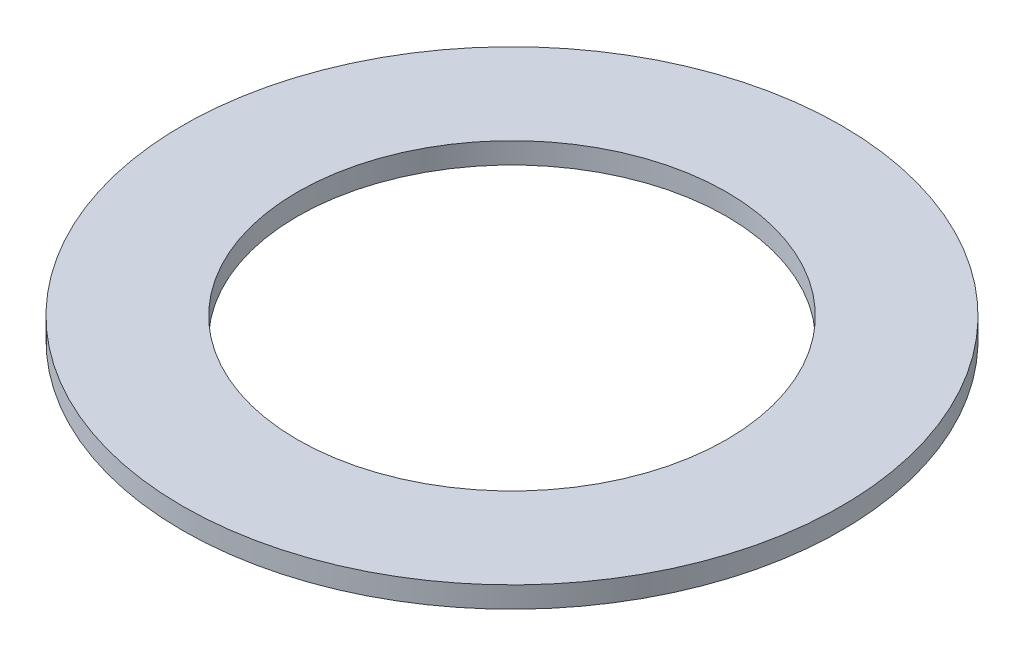
ISO-10303-21;
HEADER;
FILE_DESCRIPTION(('STEP AP214'),'2;1');
FILE_NAME('part.step','',(''),(''),'','','');
FILE_SCHEMA(('AUTOMOTIVE_DESIGN { 1 0 10303 214 1 1 1 1 }'));
ENDSEC;
DATA;
#1=APPLICATION_CONTEXT('core data for automotive mechanical design processes');
#2=APPLICATION_PROTOCOL_DEFINITION('international standard','automotive_design',2000,#1);
#3=PRODUCT_CONTEXT('',#1,'mechanical');
#4=PRODUCT('Part','Part','',(#3));
#5=PRODUCT_RELATED_PRODUCT_CATEGORY('part','',(#4));
#6=PRODUCT_DEFINITION_FORMATION('','',#4);
#7=PRODUCT_DEFINITION_CONTEXT('part definition',#1,'design');
#8=PRODUCT_DEFINITION('design','',#6,#7);
#9=PRODUCT_DEFINITION_SHAPE('','',#8);
#10=(LENGTH_UNIT() NAMED_UNIT(*) SI_UNIT(.MILLI.,.METRE.));
#11=(NAMED_UNIT(*) PLANE_ANGLE_UNIT() SI_UNIT($,.RADIAN.));
#12=(NAMED_UNIT(*) SI_UNIT($,.STERADIAN.) SOLID_ANGLE_UNIT());
#13=UNCERTAINTY_MEASURE_WITH_UNIT(LENGTH_MEASURE(1.E-05),#10,'distance_accuracy_value','');
#14=(GEOMETRIC_REPRESENTATION_CONTEXT(3) GLOBAL_UNCERTAINTY_ASSIGNED_CONTEXT((#13)) GLOBAL_UNIT_ASSIGNED_CONTEXT((#10,
#11,#12)) REPRESENTATION_CONTEXT('',''));
#15=CARTESIAN_POINT('',(0.,0.,0.));
#16=DIRECTION('',(0.,0.,1.));
#17=DIRECTION('',(1.,0.,0.));
#18=AXIS2_PLACEMENT_3D('',#15,#16,#17);
#19=CARTESIAN_POINT('',(0.,0.8128,0.));
#20=DIRECTION('',(0.,1.,0.));
#21=DIRECTION('',(0.,0.,1.));
#22=AXIS2_PLACEMENT_3D('',#19,#20,#21);
#23=PLANE('',#22);
#24=CARTESIAN_POINT('',(0.,0.8128,0.));
#25=DIRECTION('',(0.,1.,0.));
#26=DIRECTION('',(0.,0.,1.));
#27=AXIS2_PLACEMENT_3D('',#24,#25,#26);
#28=CIRCLE('',#27,8.2677);
#29=CARTESIAN_POINT('',(0.,0.8128,8.2677));
#30=VERTEX_POINT('',#29);
#31=EDGE_CURVE('E32',#30,#30,#28,.F.);
#32=ORIENTED_EDGE('',*,*,#31,.T.);
#33=EDGE_LOOP('',(#32));
#34=FACE_BOUND('',#33,.T.);
#35=CARTESIAN_POINT('',(0.,0.8128,0.));
#36=DIRECTION('',(0.,1.,0.));
#37=DIRECTION('',(0.,0.,1.));
#38=AXIS2_PLACEMENT_3D('',#35,#36,#37);
#39=CIRCLE('',#38,12.7);
#40=CARTESIAN_POINT('',(0.,0.8128,12.7));
#41=VERTEX_POINT('',#40);
#42=EDGE_CURVE('E19',#41,#41,#39,.F.);
#43=ORIENTED_EDGE('',*,*,#42,.F.);
#44=EDGE_LOOP('',(#43));
#45=FACE_BOUND('',#44,.T.);
#46=ADVANCED_FACE('F16',(#34,#45),#23,.T.);
#47=CARTESIAN_POINT('',(0.,0.,0.));
#48=DIRECTION('',(0.,1.,0.));
#49=DIRECTION('',(0.,0.,1.));
#50=AXIS2_PLACEMENT_3D('',#47,#48,#49);
#51=CYLINDRICAL_SURFACE('',#50,12.7);
#52=ORIENTED_EDGE('',*,*,#42,.T.);
#53=EDGE_LOOP('',(#52));
#54=FACE_BOUND('',#53,.T.);
#55=CARTESIAN_POINT('',(0.,0.,0.));
#56=DIRECTION('',(0.,1.,0.));
#57=DIRECTION('',(0.,0.,1.));
#58=AXIS2_PLACEMENT_3D('',#55,#56,#57);
#59=CIRCLE('',#58,12.7);
#60=CARTESIAN_POINT('',(0.,0.,12.7));
#61=VERTEX_POINT('',#60);
#62=EDGE_CURVE('E24',#61,#61,#59,.T.);
#63=ORIENTED_EDGE('',*,*,#62,.T.);
#64=EDGE_LOOP('',(#63));
#65=FACE_BOUND('',#64,.T.);
#66=ADVANCED_FACE('F41',(#54,#65),#51,.T.);
#67=CARTESIAN_POINT('',(0.,0.,0.));
#68=DIRECTION('',(0.,1.,0.));
#69=DIRECTION('',(0.,0.,1.));
#70=AXIS2_PLACEMENT_3D('',#67,#68,#69);
#71=CYLINDRICAL_SURFACE('',#70,8.2677);
#72=ORIENTED_EDGE('',*,*,#31,.F.);
#73=EDGE_LOOP('',(#72));
#74=FACE_BOUND('',#73,.T.);
#75=CARTESIAN_POINT('',(0.,0.,0.));
#76=DIRECTION('',(0.,1.,0.));
#77=DIRECTION('',(0.,0.,1.));
#78=AXIS2_PLACEMENT_3D('',#75,#76,#77);
#79=CIRCLE('',#78,8.2677);
#80=CARTESIAN_POINT('',(0.,0.,8.2677));
#81=VERTEX_POINT('',#80);
#82=EDGE_CURVE('E11',#81,#81,#79,.F.);
#83=ORIENTED_EDGE('',*,*,#82,.T.);
#84=EDGE_LOOP('',(#83));
#85=FACE_BOUND('',#84,.T.);
#86=ADVANCED_FACE('F49',(#74,#85),#71,.F.);
#87=CARTESIAN_POINT('',(0.,0.,0.));
#88=DIRECTION('',(0.,1.,0.));
#89=DIRECTION('',(0.,0.,1.));
#90=AXIS2_PLACEMENT_3D('',#87,#88,#89);
#91=PLANE('',#90);
#92=ORIENTED_EDGE('',*,*,#82,.F.);
#93=EDGE_LOOP('',(#92));
#94=FACE_BOUND('',#93,.T.);
#95=ORIENTED_EDGE('',*,*,#62,.F.);
#96=EDGE_LOOP('',(#95));
#97=FACE_BOUND('',#96,.T.);
#98=ADVANCED_FACE('F50',(#94,#97),#91,.F.);
#99=CLOSED_SHELL('',(#46,#66,#86,#98));
#100=MANIFOLD_SOLID_BREP('B1',#99);
#101=ADVANCED_BREP_SHAPE_REPRESENTATION('',(#18,#100),#14);
#102=SHAPE_DEFINITION_REPRESENTATION(#9,#101);
ENDSEC;
END-ISO-10303-21;
